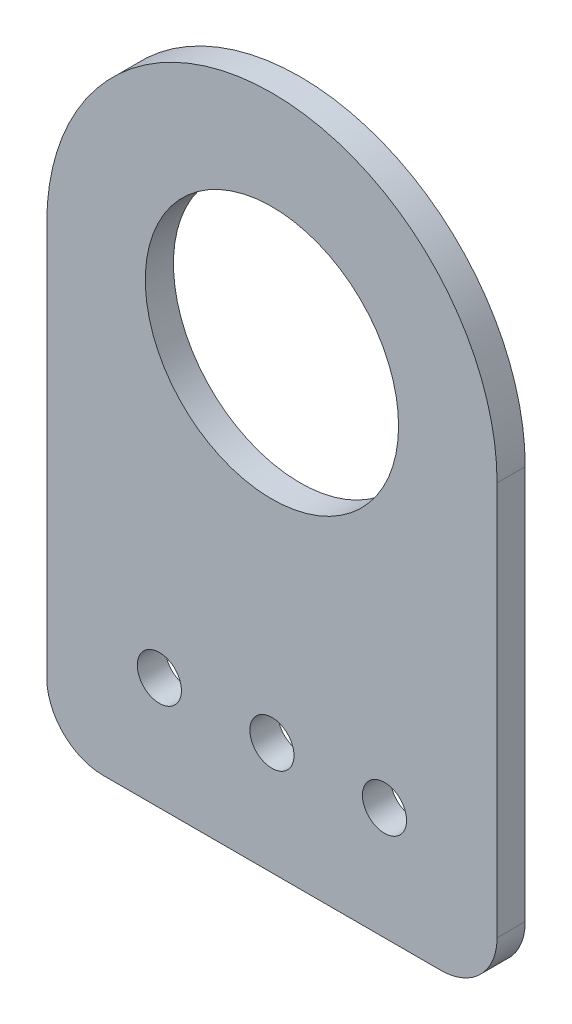
ISO-10303-21;
HEADER;
FILE_DESCRIPTION(('STEP AP214'),'2;1');
FILE_NAME('part.step','',(''),(''),'','','');
FILE_SCHEMA(('AUTOMOTIVE_DESIGN { 1 0 10303 214 1 1 1 1 }'));
ENDSEC;
DATA;
#1=APPLICATION_CONTEXT('core data for automotive mechanical design processes');
#2=APPLICATION_PROTOCOL_DEFINITION('international standard','automotive_design',2000,#1);
#3=PRODUCT_CONTEXT('',#1,'mechanical');
#4=PRODUCT('Part','Part','',(#3));
#5=PRODUCT_RELATED_PRODUCT_CATEGORY('part','',(#4));
#6=PRODUCT_DEFINITION_FORMATION('','',#4);
#7=PRODUCT_DEFINITION_CONTEXT('part definition',#1,'design');
#8=PRODUCT_DEFINITION('design','',#6,#7);
#9=PRODUCT_DEFINITION_SHAPE('','',#8);
#10=(LENGTH_UNIT() NAMED_UNIT(*) SI_UNIT(.MILLI.,.METRE.));
#11=(NAMED_UNIT(*) PLANE_ANGLE_UNIT() SI_UNIT($,.RADIAN.));
#12=(NAMED_UNIT(*) SI_UNIT($,.STERADIAN.) SOLID_ANGLE_UNIT());
#13=UNCERTAINTY_MEASURE_WITH_UNIT(LENGTH_MEASURE(1.E-05),#10,'distance_accuracy_value','');
#14=(GEOMETRIC_REPRESENTATION_CONTEXT(3) GLOBAL_UNCERTAINTY_ASSIGNED_CONTEXT((#13)) GLOBAL_UNIT_ASSIGNED_CONTEXT((#10,
#11,#12)) REPRESENTATION_CONTEXT('',''));
#15=CARTESIAN_POINT('',(0.,0.,0.));
#16=DIRECTION('',(0.,0.,1.));
#17=DIRECTION('',(1.,0.,0.));
#18=AXIS2_PLACEMENT_3D('',#15,#16,#17);
#19=CARTESIAN_POINT('',(25.4,25.4,0.));
#20=DIRECTION('',(0.,0.,1.));
#21=DIRECTION('',(1.,0.,0.));
#22=AXIS2_PLACEMENT_3D('',#19,#20,#21);
#23=PLANE('',#22);
#24=CARTESIAN_POINT('',(25.4,50.8,0.));
#25=DIRECTION('',(0.,0.,1.));
#26=DIRECTION('',(1.,0.,0.));
#27=AXIS2_PLACEMENT_3D('',#24,#25,#26);
#28=CIRCLE('',#27,14.2875);
#29=CARTESIAN_POINT('',(39.6875,50.8,0.));
#30=VERTEX_POINT('',#29);
#31=EDGE_CURVE('E118',#30,#30,#28,.T.);
#32=ORIENTED_EDGE('',*,*,#31,.T.);
#33=EDGE_LOOP('',(#32));
#34=FACE_BOUND('',#33,.T.);
#35=CARTESIAN_POINT('',(38.1,12.7,0.));
#36=DIRECTION('',(0.,0.,1.));
#37=DIRECTION('',(1.,0.,0.));
#38=AXIS2_PLACEMENT_3D('',#35,#36,#37);
#39=CIRCLE('',#38,2.4892);
#40=CARTESIAN_POINT('',(40.5892,12.7,0.));
#41=VERTEX_POINT('',#40);
#42=EDGE_CURVE('E121',#41,#41,#39,.T.);
#43=ORIENTED_EDGE('',*,*,#42,.T.);
#44=EDGE_LOOP('',(#43));
#45=FACE_BOUND('',#44,.T.);
#46=CARTESIAN_POINT('',(12.7,12.7,0.));
#47=DIRECTION('',(0.,0.,1.));
#48=DIRECTION('',(1.,0.,0.));
#49=AXIS2_PLACEMENT_3D('',#46,#47,#48);
#50=CIRCLE('',#49,2.4892);
#51=CARTESIAN_POINT('',(15.1892,12.7,0.));
#52=VERTEX_POINT('',#51);
#53=EDGE_CURVE('E88',#52,#52,#50,.T.);
#54=ORIENTED_EDGE('',*,*,#53,.T.);
#55=EDGE_LOOP('',(#54));
#56=FACE_BOUND('',#55,.T.);
#57=CARTESIAN_POINT('',(25.4,12.7,0.));
#58=DIRECTION('',(0.,0.,1.));
#59=DIRECTION('',(1.,0.,0.));
#60=AXIS2_PLACEMENT_3D('',#57,#58,#59);
#61=CIRCLE('',#60,2.4892);
#62=CARTESIAN_POINT('',(27.8892,12.7,0.));
#63=VERTEX_POINT('',#62);
#64=EDGE_CURVE('E85',#63,#63,#61,.T.);
#65=ORIENTED_EDGE('',*,*,#64,.T.);
#66=EDGE_LOOP('',(#65));
#67=FACE_BOUND('',#66,.T.);
#68=DIRECTION('',(0.,1.,0.));
#69=VECTOR('',#68,1.);
#70=CARTESIAN_POINT('',(0.,50.8,0.));
#71=LINE('',#70,#69);
#72=CARTESIAN_POINT('',(0.,50.8,0.));
#73=VERTEX_POINT('',#72);
#74=CARTESIAN_POINT('',(0.,6.35,0.));
#75=VERTEX_POINT('',#74);
#76=EDGE_CURVE('E69',#73,#75,#71,.F.);
#77=ORIENTED_EDGE('',*,*,#76,.F.);
#78=CARTESIAN_POINT('',(25.4,50.8,0.));
#79=DIRECTION('',(0.,0.,1.));
#80=DIRECTION('',(1.,0.,0.));
#81=AXIS2_PLACEMENT_3D('',#78,#79,#80);
#82=CIRCLE('',#81,25.4);
#83=CARTESIAN_POINT('',(50.8,50.8,0.));
#84=VERTEX_POINT('',#83);
#85=EDGE_CURVE('E82',#84,#73,#82,.T.);
#86=ORIENTED_EDGE('',*,*,#85,.F.);
#87=DIRECTION('',(0.,1.,0.));
#88=VECTOR('',#87,1.);
#89=CARTESIAN_POINT('',(50.8,0.,0.));
#90=LINE('',#89,#88);
#91=CARTESIAN_POINT('',(50.8,6.35,0.));
#92=VERTEX_POINT('',#91);
#93=EDGE_CURVE('E94',#92,#84,#90,.T.);
#94=ORIENTED_EDGE('',*,*,#93,.F.);
#95=CARTESIAN_POINT('',(44.45,6.35,0.));
#96=DIRECTION('',(0.,0.,1.));
#97=DIRECTION('',(1.,0.,0.));
#98=AXIS2_PLACEMENT_3D('',#95,#96,#97);
#99=CIRCLE('',#98,6.35);
#100=CARTESIAN_POINT('',(44.45,0.,0.));
#101=VERTEX_POINT('',#100);
#102=EDGE_CURVE('E126',#101,#92,#99,.T.);
#103=ORIENTED_EDGE('',*,*,#102,.F.);
#104=DIRECTION('',(1.,0.,0.));
#105=VECTOR('',#104,1.);
#106=CARTESIAN_POINT('',(0.,0.,0.));
#107=LINE('',#106,#105);
#108=CARTESIAN_POINT('',(6.35,0.,0.));
#109=VERTEX_POINT('',#108);
#110=EDGE_CURVE('E71',#109,#101,#107,.T.);
#111=ORIENTED_EDGE('',*,*,#110,.F.);
#112=CARTESIAN_POINT('',(6.35,6.35,0.));
#113=DIRECTION('',(0.,0.,1.));
#114=DIRECTION('',(1.,0.,0.));
#115=AXIS2_PLACEMENT_3D('',#112,#113,#114);
#116=CIRCLE('',#115,6.35);
#117=EDGE_CURVE('E18',#75,#109,#116,.T.);
#118=ORIENTED_EDGE('',*,*,#117,.F.);
#119=EDGE_LOOP('',(#77,#86,#94,#103,#111,#118));
#120=FACE_BOUND('',#119,.T.);
#121=ADVANCED_FACE('F15',(#34,#45,#56,#67,#120),#23,.F.);
#122=CARTESIAN_POINT('',(6.35,6.35,0.));
#123=DIRECTION('',(0.,0.,1.));
#124=DIRECTION('',(1.,0.,0.));
#125=AXIS2_PLACEMENT_3D('',#122,#123,#124);
#126=CYLINDRICAL_SURFACE('',#125,6.35);
#127=ORIENTED_EDGE('',*,*,#117,.T.);
#128=DIRECTION('',(0.,0.,-1.));
#129=VECTOR('',#128,1.);
#130=CARTESIAN_POINT('',(6.35,0.,0.));
#131=LINE('',#130,#129);
#132=CARTESIAN_POINT('',(6.35,0.,3.175));
#133=VERTEX_POINT('',#132);
#134=EDGE_CURVE('E74',#133,#109,#131,.T.);
#135=ORIENTED_EDGE('',*,*,#134,.F.);
#136=CARTESIAN_POINT('',(6.35,6.35,3.175));
#137=DIRECTION('',(0.,0.,1.));
#138=DIRECTION('',(1.,0.,0.));
#139=AXIS2_PLACEMENT_3D('',#136,#137,#138);
#140=CIRCLE('',#139,6.35);
#141=CARTESIAN_POINT('',(0.,6.35,3.175));
#142=VERTEX_POINT('',#141);
#143=EDGE_CURVE('E79',#142,#133,#140,.T.);
#144=ORIENTED_EDGE('',*,*,#143,.F.);
#145=DIRECTION('',(0.,0.,1.));
#146=VECTOR('',#145,1.);
#147=CARTESIAN_POINT('',(0.,6.35,0.));
#148=LINE('',#147,#146);
#149=EDGE_CURVE('E76',#75,#142,#148,.T.);
#150=ORIENTED_EDGE('',*,*,#149,.F.);
#151=EDGE_LOOP('',(#127,#135,#144,#150));
#152=FACE_BOUND('',#151,.T.);
#153=ADVANCED_FACE('F77',(#152),#126,.T.);
#154=CARTESIAN_POINT('',(0.,0.,0.));
#155=DIRECTION('',(0.,-1.,0.));
#156=DIRECTION('',(0.,0.,-1.));
#157=AXIS2_PLACEMENT_3D('',#154,#155,#156);
#158=PLANE('',#157);
#159=DIRECTION('',(0.,0.,1.));
#160=VECTOR('',#159,1.);
#161=CARTESIAN_POINT('',(44.45,0.,0.));
#162=LINE('',#161,#160);
#163=CARTESIAN_POINT('',(44.45,0.,3.175));
#164=VERTEX_POINT('',#163);
#165=EDGE_CURVE('E98',#164,#101,#162,.F.);
#166=ORIENTED_EDGE('',*,*,#165,.F.);
#167=DIRECTION('',(1.,0.,0.));
#168=VECTOR('',#167,1.);
#169=CARTESIAN_POINT('',(25.4,0.,3.175));
#170=LINE('',#169,#168);
#171=EDGE_CURVE('E116',#133,#164,#170,.T.);
#172=ORIENTED_EDGE('',*,*,#171,.F.);
#173=ORIENTED_EDGE('',*,*,#134,.T.);
#174=ORIENTED_EDGE('',*,*,#110,.T.);
#175=EDGE_LOOP('',(#166,#172,#173,#174));
#176=FACE_BOUND('',#175,.T.);
#177=ADVANCED_FACE('F149',(#176),#158,.T.);
#178=CARTESIAN_POINT('',(44.45,6.35,0.));
#179=DIRECTION('',(0.,0.,1.));
#180=DIRECTION('',(1.,0.,0.));
#181=AXIS2_PLACEMENT_3D('',#178,#179,#180);
#182=CYLINDRICAL_SURFACE('',#181,6.35);
#183=ORIENTED_EDGE('',*,*,#102,.T.);
#184=DIRECTION('',(0.,0.,1.));
#185=VECTOR('',#184,1.);
#186=CARTESIAN_POINT('',(50.8,6.35,0.));
#187=LINE('',#186,#185);
#188=CARTESIAN_POINT('',(50.8,6.35,3.175));
#189=VERTEX_POINT('',#188);
#190=EDGE_CURVE('E97',#189,#92,#187,.F.);
#191=ORIENTED_EDGE('',*,*,#190,.F.);
#192=CARTESIAN_POINT('',(44.45,6.35,3.175));
#193=DIRECTION('',(0.,0.,1.));
#194=DIRECTION('',(1.,0.,0.));
#195=AXIS2_PLACEMENT_3D('',#192,#193,#194);
#196=CIRCLE('',#195,6.35);
#197=EDGE_CURVE('E113',#164,#189,#196,.T.);
#198=ORIENTED_EDGE('',*,*,#197,.F.);
#199=ORIENTED_EDGE('',*,*,#165,.T.);
#200=EDGE_LOOP('',(#183,#191,#198,#199));
#201=FACE_BOUND('',#200,.T.);
#202=ADVANCED_FACE('F146',(#201),#182,.T.);
#203=CARTESIAN_POINT('',(50.8,0.,0.));
#204=DIRECTION('',(1.,0.,0.));
#205=DIRECTION('',(0.,1.,0.));
#206=AXIS2_PLACEMENT_3D('',#203,#204,#205);
#207=PLANE('',#206);
#208=DIRECTION('',(0.,0.,1.));
#209=VECTOR('',#208,1.);
#210=CARTESIAN_POINT('',(50.8,50.8,0.));
#211=LINE('',#210,#209);
#212=CARTESIAN_POINT('',(50.8,50.8,3.175));
#213=VERTEX_POINT('',#212);
#214=EDGE_CURVE('E96',#213,#84,#211,.F.);
#215=ORIENTED_EDGE('',*,*,#214,.F.);
#216=DIRECTION('',(0.,1.,0.));
#217=VECTOR('',#216,1.);
#218=CARTESIAN_POINT('',(50.8,25.4,3.175));
#219=LINE('',#218,#217);
#220=EDGE_CURVE('E112',#189,#213,#219,.T.);
#221=ORIENTED_EDGE('',*,*,#220,.F.);
#222=ORIENTED_EDGE('',*,*,#190,.T.);
#223=ORIENTED_EDGE('',*,*,#93,.T.);
#224=EDGE_LOOP('',(#215,#221,#222,#223));
#225=FACE_BOUND('',#224,.T.);
#226=ADVANCED_FACE('F145',(#225),#207,.T.);
#227=CARTESIAN_POINT('',(25.4,50.8,0.));
#228=DIRECTION('',(0.,0.,1.));
#229=DIRECTION('',(1.,0.,0.));
#230=AXIS2_PLACEMENT_3D('',#227,#228,#229);
#231=CYLINDRICAL_SURFACE('',#230,25.4);
#232=ORIENTED_EDGE('',*,*,#214,.T.);
#233=ORIENTED_EDGE('',*,*,#85,.T.);
#234=DIRECTION('',(0.,0.,1.));
#235=VECTOR('',#234,1.);
#236=CARTESIAN_POINT('',(0.,50.8,0.));
#237=LINE('',#236,#235);
#238=CARTESIAN_POINT('',(0.,50.8,3.175));
#239=VERTEX_POINT('',#238);
#240=EDGE_CURVE('E33',#239,#73,#237,.F.);
#241=ORIENTED_EDGE('',*,*,#240,.F.);
#242=CARTESIAN_POINT('',(25.4,50.8,3.175));
#243=DIRECTION('',(0.,0.,1.));
#244=DIRECTION('',(1.,0.,0.));
#245=AXIS2_PLACEMENT_3D('',#242,#243,#244);
#246=CIRCLE('',#245,25.4);
#247=EDGE_CURVE('E109',#213,#239,#246,.T.);
#248=ORIENTED_EDGE('',*,*,#247,.F.);
#249=EDGE_LOOP('',(#232,#233,#241,#248));
#250=FACE_BOUND('',#249,.T.);
#251=ADVANCED_FACE('F143',(#250),#231,.T.);
#252=CARTESIAN_POINT('',(0.,50.8,0.));
#253=DIRECTION('',(-1.,0.,0.));
#254=DIRECTION('',(0.,0.,1.));
#255=AXIS2_PLACEMENT_3D('',#252,#253,#254);
#256=PLANE('',#255);
#257=ORIENTED_EDGE('',*,*,#240,.T.);
#258=ORIENTED_EDGE('',*,*,#76,.T.);
#259=ORIENTED_EDGE('',*,*,#149,.T.);
#260=DIRECTION('',(0.,1.,0.));
#261=VECTOR('',#260,1.);
#262=CARTESIAN_POINT('',(0.,25.4,3.175));
#263=LINE('',#262,#261);
#264=EDGE_CURVE('E108',#239,#142,#263,.F.);
#265=ORIENTED_EDGE('',*,*,#264,.F.);
#266=EDGE_LOOP('',(#257,#258,#259,#265));
#267=FACE_BOUND('',#266,.T.);
#268=ADVANCED_FACE('F84',(#267),#256,.T.);
#269=CARTESIAN_POINT('',(25.4,12.7,-88.4610225293524));
#270=DIRECTION('',(0.,0.,1.));
#271=DIRECTION('',(1.,0.,0.));
#272=AXIS2_PLACEMENT_3D('',#269,#270,#271);
#273=CYLINDRICAL_SURFACE('',#272,2.4892);
#274=CARTESIAN_POINT('',(25.4,12.7,3.175));
#275=DIRECTION('',(0.,0.,1.));
#276=DIRECTION('',(1.,0.,0.));
#277=AXIS2_PLACEMENT_3D('',#274,#275,#276);
#278=CIRCLE('',#277,2.4892);
#279=CARTESIAN_POINT('',(27.8892,12.7,3.175));
#280=VERTEX_POINT('',#279);
#281=EDGE_CURVE('E105',#280,#280,#278,.F.);
#282=ORIENTED_EDGE('',*,*,#281,.F.);
#283=EDGE_LOOP('',(#282));
#284=FACE_BOUND('',#283,.T.);
#285=ORIENTED_EDGE('',*,*,#64,.F.);
#286=EDGE_LOOP('',(#285));
#287=FACE_BOUND('',#286,.T.);
#288=ADVANCED_FACE('F176',(#284,#287),#273,.F.);
#289=CARTESIAN_POINT('',(12.7,12.7,-88.4610225293524));
#290=DIRECTION('',(0.,0.,1.));
#291=DIRECTION('',(1.,0.,0.));
#292=AXIS2_PLACEMENT_3D('',#289,#290,#291);
#293=CYLINDRICAL_SURFACE('',#292,2.4892);
#294=CARTESIAN_POINT('',(12.7,12.7,3.175));
#295=DIRECTION('',(0.,0.,1.));
#296=DIRECTION('',(1.,0.,0.));
#297=AXIS2_PLACEMENT_3D('',#294,#295,#296);
#298=CIRCLE('',#297,2.4892);
#299=CARTESIAN_POINT('',(15.1892,12.7,3.175));
#300=VERTEX_POINT('',#299);
#301=EDGE_CURVE('E102',#300,#300,#298,.F.);
#302=ORIENTED_EDGE('',*,*,#301,.F.);
#303=EDGE_LOOP('',(#302));
#304=FACE_BOUND('',#303,.T.);
#305=ORIENTED_EDGE('',*,*,#53,.F.);
#306=EDGE_LOOP('',(#305));
#307=FACE_BOUND('',#306,.T.);
#308=ADVANCED_FACE('F172',(#304,#307),#293,.F.);
#309=CARTESIAN_POINT('',(38.1,12.7,-88.4610225293524));
#310=DIRECTION('',(0.,0.,1.));
#311=DIRECTION('',(1.,0.,0.));
#312=AXIS2_PLACEMENT_3D('',#309,#310,#311);
#313=CYLINDRICAL_SURFACE('',#312,2.4892);
#314=CARTESIAN_POINT('',(38.1,12.7,3.175));
#315=DIRECTION('',(0.,0.,1.));
#316=DIRECTION('',(1.,0.,0.));
#317=AXIS2_PLACEMENT_3D('',#314,#315,#316);
#318=CIRCLE('',#317,2.4892);
#319=CARTESIAN_POINT('',(40.5892,12.7,3.175));
#320=VERTEX_POINT('',#319);
#321=EDGE_CURVE('E24',#320,#320,#318,.F.);
#322=ORIENTED_EDGE('',*,*,#321,.F.);
#323=EDGE_LOOP('',(#322));
#324=FACE_BOUND('',#323,.T.);
#325=ORIENTED_EDGE('',*,*,#42,.F.);
#326=EDGE_LOOP('',(#325));
#327=FACE_BOUND('',#326,.T.);
#328=ADVANCED_FACE('F165',(#324,#327),#313,.F.);
#329=CARTESIAN_POINT('',(25.4,50.8,-88.4610225293524));
#330=DIRECTION('',(0.,0.,1.));
#331=DIRECTION('',(1.,0.,0.));
#332=AXIS2_PLACEMENT_3D('',#329,#330,#331);
#333=CYLINDRICAL_SURFACE('',#332,14.2875);
#334=CARTESIAN_POINT('',(25.4,50.8,3.175));
#335=DIRECTION('',(0.,0.,1.));
#336=DIRECTION('',(1.,0.,0.));
#337=AXIS2_PLACEMENT_3D('',#334,#335,#336);
#338=CIRCLE('',#337,14.2875);
#339=CARTESIAN_POINT('',(39.6875,50.8,3.175));
#340=VERTEX_POINT('',#339);
#341=EDGE_CURVE('E9',#340,#340,#338,.F.);
#342=ORIENTED_EDGE('',*,*,#341,.F.);
#343=EDGE_LOOP('',(#342));
#344=FACE_BOUND('',#343,.T.);
#345=ORIENTED_EDGE('',*,*,#31,.F.);
#346=EDGE_LOOP('',(#345));
#347=FACE_BOUND('',#346,.T.);
#348=ADVANCED_FACE('F159',(#344,#347),#333,.F.);
#349=CARTESIAN_POINT('',(25.4,25.4,3.175));
#350=DIRECTION('',(0.,0.,1.));
#351=DIRECTION('',(1.,0.,0.));
#352=AXIS2_PLACEMENT_3D('',#349,#350,#351);
#353=PLANE('',#352);
#354=ORIENTED_EDGE('',*,*,#341,.T.);
#355=EDGE_LOOP('',(#354));
#356=FACE_BOUND('',#355,.T.);
#357=ORIENTED_EDGE('',*,*,#321,.T.);
#358=EDGE_LOOP('',(#357));
#359=FACE_BOUND('',#358,.T.);
#360=ORIENTED_EDGE('',*,*,#301,.T.);
#361=EDGE_LOOP('',(#360));
#362=FACE_BOUND('',#361,.T.);
#363=ORIENTED_EDGE('',*,*,#281,.T.);
#364=EDGE_LOOP('',(#363));
#365=FACE_BOUND('',#364,.T.);
#366=ORIENTED_EDGE('',*,*,#247,.T.);
#367=ORIENTED_EDGE('',*,*,#264,.T.);
#368=ORIENTED_EDGE('',*,*,#143,.T.);
#369=ORIENTED_EDGE('',*,*,#171,.T.);
#370=ORIENTED_EDGE('',*,*,#197,.T.);
#371=ORIENTED_EDGE('',*,*,#220,.T.);
#372=EDGE_LOOP('',(#366,#367,#368,#369,#370,#371));
#373=FACE_BOUND('',#372,.T.);
#374=ADVANCED_FACE('F141',(#356,#359,#362,#365,#373),#353,.T.);
#375=CLOSED_SHELL('',(#121,#153,#177,#202,#226,#251,#268,#288,#308,#328,#348,#374));
#376=MANIFOLD_SOLID_BREP('B1',#375);
#377=ADVANCED_BREP_SHAPE_REPRESENTATION('',(#18,#376),#14);
#378=SHAPE_DEFINITION_REPRESENTATION(#9,#377);
ENDSEC;
END-ISO-10303-21;
